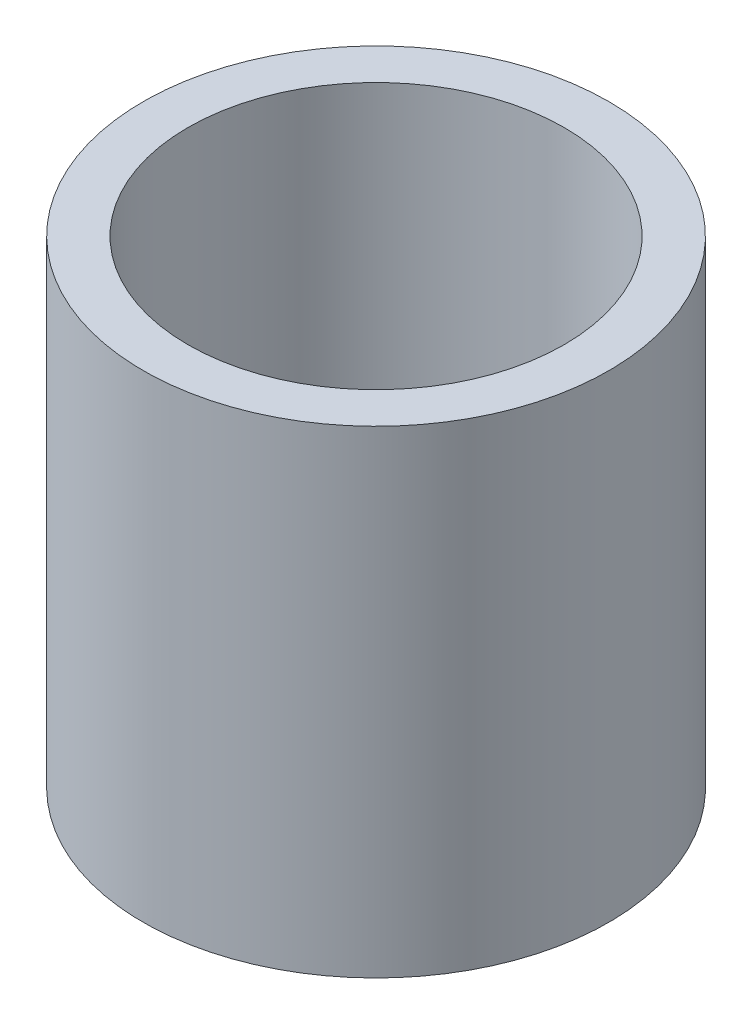
ISO-10303-21;
HEADER;
FILE_DESCRIPTION(('STEP AP214'),'2;1');
FILE_NAME('part.step','',(''),(''),'','','');
FILE_SCHEMA(('AUTOMOTIVE_DESIGN { 1 0 10303 214 1 1 1 1 }'));
ENDSEC;
DATA;
#1=APPLICATION_CONTEXT('core data for automotive mechanical design processes');
#2=APPLICATION_PROTOCOL_DEFINITION('international standard','automotive_design',2000,#1);
#3=PRODUCT_CONTEXT('',#1,'mechanical');
#4=PRODUCT('Part','Part','',(#3));
#5=PRODUCT_RELATED_PRODUCT_CATEGORY('part','',(#4));
#6=PRODUCT_DEFINITION_FORMATION('','',#4);
#7=PRODUCT_DEFINITION_CONTEXT('part definition',#1,'design');
#8=PRODUCT_DEFINITION('design','',#6,#7);
#9=PRODUCT_DEFINITION_SHAPE('','',#8);
#10=(LENGTH_UNIT() NAMED_UNIT(*) SI_UNIT(.MILLI.,.METRE.));
#11=(NAMED_UNIT(*) PLANE_ANGLE_UNIT() SI_UNIT($,.RADIAN.));
#12=(NAMED_UNIT(*) SI_UNIT($,.STERADIAN.) SOLID_ANGLE_UNIT());
#13=UNCERTAINTY_MEASURE_WITH_UNIT(LENGTH_MEASURE(1.E-05),#10,'distance_accuracy_value','');
#14=(GEOMETRIC_REPRESENTATION_CONTEXT(3) GLOBAL_UNCERTAINTY_ASSIGNED_CONTEXT((#13)) GLOBAL_UNIT_ASSIGNED_CONTEXT((#10,
#11,#12)) REPRESENTATION_CONTEXT('',''));
#15=CARTESIAN_POINT('',(0.,0.,0.));
#16=DIRECTION('',(0.,0.,1.));
#17=DIRECTION('',(1.,0.,0.));
#18=AXIS2_PLACEMENT_3D('',#15,#16,#17);
#19=CARTESIAN_POINT('',(0.,8.,0.));
#20=DIRECTION('',(0.,-1.,0.));
#21=DIRECTION('',(0.,0.,-1.));
#22=AXIS2_PLACEMENT_3D('',#19,#20,#21);
#23=CYLINDRICAL_SURFACE('',#22,3.15);
#24=CARTESIAN_POINT('',(0.,0.,0.));
#25=DIRECTION('',(0.,-1.,0.));
#26=DIRECTION('',(0.,0.,-1.));
#27=AXIS2_PLACEMENT_3D('',#24,#25,#26);
#28=CIRCLE('',#27,3.15);
#29=CARTESIAN_POINT('',(0.,0.,-3.15));
#30=VERTEX_POINT('',#29);
#31=EDGE_CURVE('E26',#30,#30,#28,.T.);
#32=ORIENTED_EDGE('',*,*,#31,.T.);
#33=EDGE_LOOP('',(#32));
#34=FACE_BOUND('',#33,.T.);
#35=CARTESIAN_POINT('',(0.,8.,0.));
#36=DIRECTION('',(0.,-1.,0.));
#37=DIRECTION('',(0.,0.,-1.));
#38=AXIS2_PLACEMENT_3D('',#35,#36,#37);
#39=CIRCLE('',#38,3.15);
#40=CARTESIAN_POINT('',(0.,8.,-3.15));
#41=VERTEX_POINT('',#40);
#42=EDGE_CURVE('E17',#41,#41,#39,.T.);
#43=ORIENTED_EDGE('',*,*,#42,.F.);
#44=EDGE_LOOP('',(#43));
#45=FACE_BOUND('',#44,.T.);
#46=ADVANCED_FACE('F14',(#34,#45),#23,.F.);
#47=CARTESIAN_POINT('',(0.,8.,0.));
#48=DIRECTION('',(0.,1.,0.));
#49=DIRECTION('',(0.,0.,1.));
#50=AXIS2_PLACEMENT_3D('',#47,#48,#49);
#51=PLANE('',#50);
#52=ORIENTED_EDGE('',*,*,#42,.T.);
#53=EDGE_LOOP('',(#52));
#54=FACE_BOUND('',#53,.T.);
#55=CARTESIAN_POINT('',(0.,8.,0.));
#56=DIRECTION('',(0.,-1.,0.));
#57=DIRECTION('',(0.,0.,-1.));
#58=AXIS2_PLACEMENT_3D('',#55,#56,#57);
#59=CIRCLE('',#58,3.9);
#60=CARTESIAN_POINT('',(0.,8.,-3.9));
#61=VERTEX_POINT('',#60);
#62=EDGE_CURVE('E21',#61,#61,#59,.T.);
#63=ORIENTED_EDGE('',*,*,#62,.F.);
#64=EDGE_LOOP('',(#63));
#65=FACE_BOUND('',#64,.T.);
#66=ADVANCED_FACE('F34',(#54,#65),#51,.T.);
#67=CARTESIAN_POINT('',(0.,0.,0.));
#68=DIRECTION('',(0.,1.,0.));
#69=DIRECTION('',(0.,0.,1.));
#70=AXIS2_PLACEMENT_3D('',#67,#68,#69);
#71=PLANE('',#70);
#72=ORIENTED_EDGE('',*,*,#31,.F.);
#73=EDGE_LOOP('',(#72));
#74=FACE_BOUND('',#73,.T.);
#75=CARTESIAN_POINT('',(0.,0.,0.));
#76=DIRECTION('',(0.,-1.,0.));
#77=DIRECTION('',(0.,0.,-1.));
#78=AXIS2_PLACEMENT_3D('',#75,#76,#77);
#79=CIRCLE('',#78,3.9);
#80=CARTESIAN_POINT('',(0.,0.,-3.9));
#81=VERTEX_POINT('',#80);
#82=EDGE_CURVE('E10',#81,#81,#79,.F.);
#83=ORIENTED_EDGE('',*,*,#82,.F.);
#84=EDGE_LOOP('',(#83));
#85=FACE_BOUND('',#84,.T.);
#86=ADVANCED_FACE('F42',(#74,#85),#71,.F.);
#87=CARTESIAN_POINT('',(0.,8.,0.));
#88=DIRECTION('',(0.,-1.,0.));
#89=DIRECTION('',(0.,0.,-1.));
#90=AXIS2_PLACEMENT_3D('',#87,#88,#89);
#91=CYLINDRICAL_SURFACE('',#90,3.9);
#92=ORIENTED_EDGE('',*,*,#82,.T.);
#93=EDGE_LOOP('',(#92));
#94=FACE_BOUND('',#93,.T.);
#95=ORIENTED_EDGE('',*,*,#62,.T.);
#96=EDGE_LOOP('',(#95));
#97=FACE_BOUND('',#96,.T.);
#98=ADVANCED_FACE('F43',(#94,#97),#91,.T.);
#99=CLOSED_SHELL('',(#46,#66,#86,#98));
#100=MANIFOLD_SOLID_BREP('B1',#99);
#101=ADVANCED_BREP_SHAPE_REPRESENTATION('',(#18,#100),#14);
#102=SHAPE_DEFINITION_REPRESENTATION(#9,#101);
ENDSEC;
END-ISO-10303-21;
